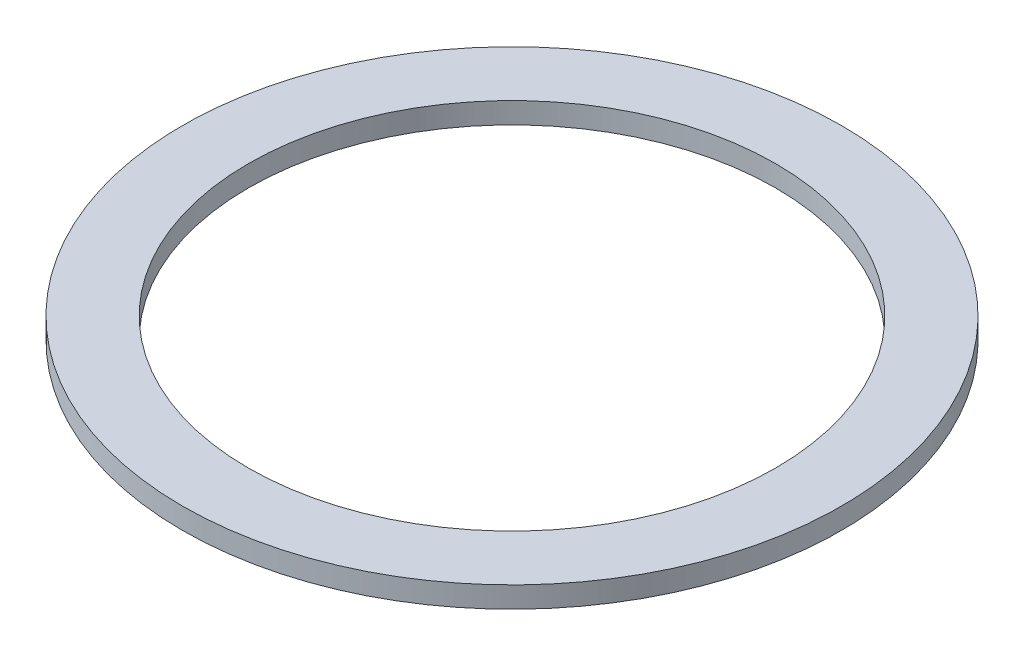
ISO-10303-21;
HEADER;
FILE_DESCRIPTION(('STEP AP214'),'2;1');
FILE_NAME('part.step','',(''),(''),'','','');
FILE_SCHEMA(('AUTOMOTIVE_DESIGN { 1 0 10303 214 1 1 1 1 }'));
ENDSEC;
DATA;
#1=APPLICATION_CONTEXT('core data for automotive mechanical design processes');
#2=APPLICATION_PROTOCOL_DEFINITION('international standard','automotive_design',2000,#1);
#3=PRODUCT_CONTEXT('',#1,'mechanical');
#4=PRODUCT('Part','Part','',(#3));
#5=PRODUCT_RELATED_PRODUCT_CATEGORY('part','',(#4));
#6=PRODUCT_DEFINITION_FORMATION('','',#4);
#7=PRODUCT_DEFINITION_CONTEXT('part definition',#1,'design');
#8=PRODUCT_DEFINITION('design','',#6,#7);
#9=PRODUCT_DEFINITION_SHAPE('','',#8);
#10=(LENGTH_UNIT() NAMED_UNIT(*) SI_UNIT(.MILLI.,.METRE.));
#11=(NAMED_UNIT(*) PLANE_ANGLE_UNIT() SI_UNIT($,.RADIAN.));
#12=(NAMED_UNIT(*) SI_UNIT($,.STERADIAN.) SOLID_ANGLE_UNIT());
#13=UNCERTAINTY_MEASURE_WITH_UNIT(LENGTH_MEASURE(1.E-05),#10,'distance_accuracy_value','');
#14=(GEOMETRIC_REPRESENTATION_CONTEXT(3) GLOBAL_UNCERTAINTY_ASSIGNED_CONTEXT((#13)) GLOBAL_UNIT_ASSIGNED_CONTEXT((#10,
#11,#12)) REPRESENTATION_CONTEXT('',''));
#15=CARTESIAN_POINT('',(0.,0.,0.));
#16=DIRECTION('',(0.,0.,1.));
#17=DIRECTION('',(1.,0.,0.));
#18=AXIS2_PLACEMENT_3D('',#15,#16,#17);
#19=CARTESIAN_POINT('',(0.,4.,0.));
#20=DIRECTION('',(0.,-1.,0.));
#21=DIRECTION('',(0.,0.,-1.));
#22=AXIS2_PLACEMENT_3D('',#19,#20,#21);
#23=CYLINDRICAL_SURFACE('',#22,62.5);
#24=CARTESIAN_POINT('',(0.,4.,0.));
#25=DIRECTION('',(0.,1.,0.));
#26=DIRECTION('',(0.,0.,1.));
#27=AXIS2_PLACEMENT_3D('',#24,#25,#26);
#28=CIRCLE('',#27,62.5);
#29=CARTESIAN_POINT('',(0.,4.,62.5));
#30=VERTEX_POINT('',#29);
#31=EDGE_CURVE('E10',#30,#30,#28,.T.);
#32=ORIENTED_EDGE('',*,*,#31,.F.);
#33=EDGE_LOOP('',(#32));
#34=FACE_BOUND('',#33,.T.);
#35=CARTESIAN_POINT('',(0.,0.,0.));
#36=DIRECTION('',(0.,1.,0.));
#37=DIRECTION('',(0.,0.,1.));
#38=AXIS2_PLACEMENT_3D('',#35,#36,#37);
#39=CIRCLE('',#38,62.5);
#40=CARTESIAN_POINT('',(0.,0.,62.5));
#41=VERTEX_POINT('',#40);
#42=EDGE_CURVE('E37',#41,#41,#39,.T.);
#43=ORIENTED_EDGE('',*,*,#42,.T.);
#44=EDGE_LOOP('',(#43));
#45=FACE_BOUND('',#44,.T.);
#46=ADVANCED_FACE('F40',(#34,#45),#23,.T.);
#47=CARTESIAN_POINT('',(0.,4.,0.));
#48=DIRECTION('',(0.,1.,0.));
#49=DIRECTION('',(0.,0.,1.));
#50=AXIS2_PLACEMENT_3D('',#47,#48,#49);
#51=PLANE('',#50);
#52=CARTESIAN_POINT('',(0.,4.,0.));
#53=DIRECTION('',(0.,1.,0.));
#54=DIRECTION('',(0.,0.,1.));
#55=AXIS2_PLACEMENT_3D('',#52,#53,#54);
#56=CIRCLE('',#55,50.);
#57=CARTESIAN_POINT('',(0.,4.,50.));
#58=VERTEX_POINT('',#57);
#59=EDGE_CURVE('E50',#58,#58,#56,.T.);
#60=ORIENTED_EDGE('',*,*,#59,.F.);
#61=EDGE_LOOP('',(#60));
#62=FACE_BOUND('',#61,.T.);
#63=ORIENTED_EDGE('',*,*,#31,.T.);
#64=EDGE_LOOP('',(#63));
#65=FACE_BOUND('',#64,.T.);
#66=ADVANCED_FACE('F59',(#62,#65),#51,.T.);
#67=CARTESIAN_POINT('',(0.,0.,0.));
#68=DIRECTION('',(0.,1.,0.));
#69=DIRECTION('',(0.,0.,1.));
#70=AXIS2_PLACEMENT_3D('',#67,#68,#69);
#71=PLANE('',#70);
#72=CARTESIAN_POINT('',(0.,0.,0.));
#73=DIRECTION('',(0.,1.,0.));
#74=DIRECTION('',(0.,0.,1.));
#75=AXIS2_PLACEMENT_3D('',#72,#73,#74);
#76=CIRCLE('',#75,50.);
#77=CARTESIAN_POINT('',(0.,0.,50.));
#78=VERTEX_POINT('',#77);
#79=EDGE_CURVE('E47',#78,#78,#76,.T.);
#80=ORIENTED_EDGE('',*,*,#79,.T.);
#81=EDGE_LOOP('',(#80));
#82=FACE_BOUND('',#81,.T.);
#83=ORIENTED_EDGE('',*,*,#42,.F.);
#84=EDGE_LOOP('',(#83));
#85=FACE_BOUND('',#84,.T.);
#86=ADVANCED_FACE('F58',(#82,#85),#71,.F.);
#87=CARTESIAN_POINT('',(0.,4.,0.));
#88=DIRECTION('',(0.,-1.,0.));
#89=DIRECTION('',(0.,0.,-1.));
#90=AXIS2_PLACEMENT_3D('',#87,#88,#89);
#91=CYLINDRICAL_SURFACE('',#90,50.);
#92=ORIENTED_EDGE('',*,*,#59,.T.);
#93=EDGE_LOOP('',(#92));
#94=FACE_BOUND('',#93,.T.);
#95=ORIENTED_EDGE('',*,*,#79,.F.);
#96=EDGE_LOOP('',(#95));
#97=FACE_BOUND('',#96,.T.);
#98=ADVANCED_FACE('F54',(#94,#97),#91,.F.);
#99=CLOSED_SHELL('',(#46,#66,#86,#98));
#100=MANIFOLD_SOLID_BREP('B2',#99);
#101=ADVANCED_BREP_SHAPE_REPRESENTATION('',(#18,#100),#14);
#102=SHAPE_DEFINITION_REPRESENTATION(#9,#101);
ENDSEC;
END-ISO-10303-21;
